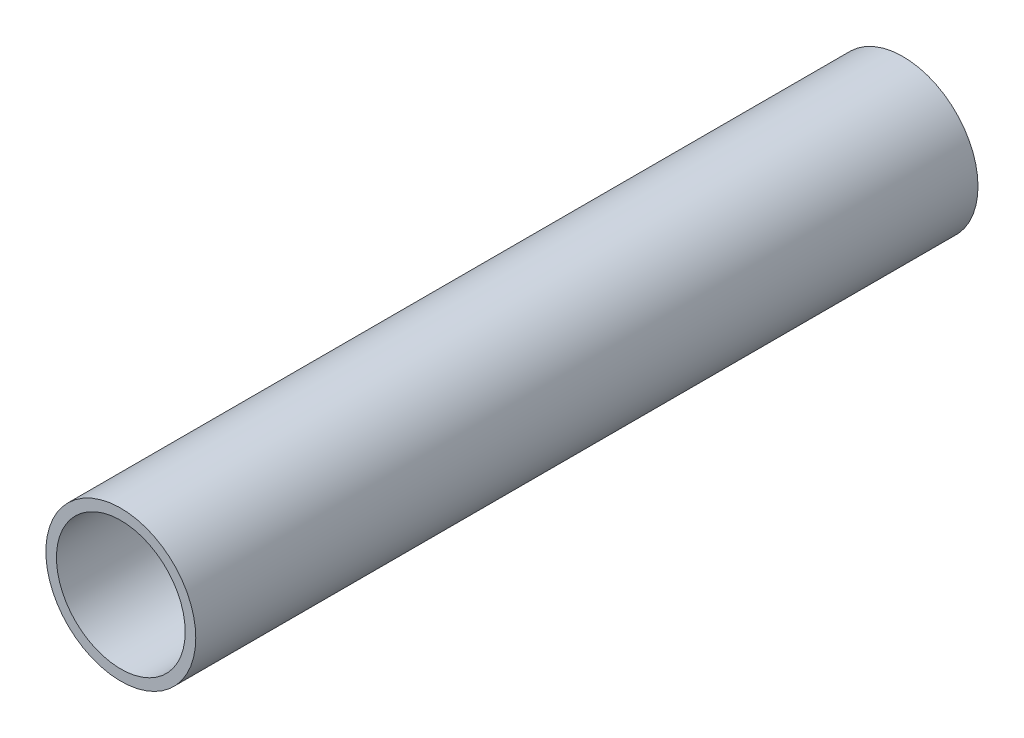
ISO-10303-21;
HEADER;
FILE_DESCRIPTION(('STEP AP214'),'2;1');
FILE_NAME('part.step','',(''),(''),'','','');
FILE_SCHEMA(('AUTOMOTIVE_DESIGN { 1 0 10303 214 1 1 1 1 }'));
ENDSEC;
DATA;
#1=APPLICATION_CONTEXT('core data for automotive mechanical design processes');
#2=APPLICATION_PROTOCOL_DEFINITION('international standard','automotive_design',2000,#1);
#3=PRODUCT_CONTEXT('',#1,'mechanical');
#4=PRODUCT('Part','Part','',(#3));
#5=PRODUCT_RELATED_PRODUCT_CATEGORY('part','',(#4));
#6=PRODUCT_DEFINITION_FORMATION('','',#4);
#7=PRODUCT_DEFINITION_CONTEXT('part definition',#1,'design');
#8=PRODUCT_DEFINITION('design','',#6,#7);
#9=PRODUCT_DEFINITION_SHAPE('','',#8);
#10=(LENGTH_UNIT() NAMED_UNIT(*) SI_UNIT(.MILLI.,.METRE.));
#11=(NAMED_UNIT(*) PLANE_ANGLE_UNIT() SI_UNIT($,.RADIAN.));
#12=(NAMED_UNIT(*) SI_UNIT($,.STERADIAN.) SOLID_ANGLE_UNIT());
#13=UNCERTAINTY_MEASURE_WITH_UNIT(LENGTH_MEASURE(1.E-05),#10,'distance_accuracy_value','');
#14=(GEOMETRIC_REPRESENTATION_CONTEXT(3) GLOBAL_UNCERTAINTY_ASSIGNED_CONTEXT((#13)) GLOBAL_UNIT_ASSIGNED_CONTEXT((#10,
#11,#12)) REPRESENTATION_CONTEXT('',''));
#15=CARTESIAN_POINT('',(0.,0.,0.));
#16=DIRECTION('',(0.,0.,1.));
#17=DIRECTION('',(1.,0.,0.));
#18=AXIS2_PLACEMENT_3D('',#15,#16,#17);
#19=CARTESIAN_POINT('',(0.,0.,381.));
#20=DIRECTION('',(0.,0.,1.));
#21=DIRECTION('',(1.,0.,0.));
#22=AXIS2_PLACEMENT_3D('',#19,#20,#21);
#23=PLANE('',#22);
#24=CARTESIAN_POINT('',(0.,0.,381.));
#25=DIRECTION('',(0.,0.,1.));
#26=DIRECTION('',(1.,0.,0.));
#27=AXIS2_PLACEMENT_3D('',#24,#25,#26);
#28=CIRCLE('',#27,36.5125);
#29=CARTESIAN_POINT('',(36.5125,0.,381.));
#30=VERTEX_POINT('',#29);
#31=EDGE_CURVE('E10',#30,#30,#28,.T.);
#32=ORIENTED_EDGE('',*,*,#31,.T.);
#33=EDGE_LOOP('',(#32));
#34=FACE_BOUND('',#33,.T.);
#35=CARTESIAN_POINT('',(0.,0.,381.));
#36=DIRECTION('',(0.,0.,1.));
#37=DIRECTION('',(1.,0.,0.));
#38=AXIS2_PLACEMENT_3D('',#35,#36,#37);
#39=CIRCLE('',#38,31.3563);
#40=CARTESIAN_POINT('',(31.3563,0.,381.));
#41=VERTEX_POINT('',#40);
#42=EDGE_CURVE('E42',#41,#41,#39,.T.);
#43=ORIENTED_EDGE('',*,*,#42,.F.);
#44=EDGE_LOOP('',(#43));
#45=FACE_BOUND('',#44,.T.);
#46=ADVANCED_FACE('F31',(#34,#45),#23,.T.);
#47=CARTESIAN_POINT('',(0.,0.,0.));
#48=DIRECTION('',(0.,0.,1.));
#49=DIRECTION('',(1.,0.,0.));
#50=AXIS2_PLACEMENT_3D('',#47,#48,#49);
#51=PLANE('',#50);
#52=CARTESIAN_POINT('',(0.,0.,0.));
#53=DIRECTION('',(0.,0.,1.));
#54=DIRECTION('',(1.,0.,0.));
#55=AXIS2_PLACEMENT_3D('',#52,#53,#54);
#56=CIRCLE('',#55,36.5125);
#57=CARTESIAN_POINT('',(36.5125,0.,0.));
#58=VERTEX_POINT('',#57);
#59=EDGE_CURVE('E35',#58,#58,#56,.T.);
#60=ORIENTED_EDGE('',*,*,#59,.F.);
#61=EDGE_LOOP('',(#60));
#62=FACE_BOUND('',#61,.T.);
#63=CARTESIAN_POINT('',(0.,0.,0.));
#64=DIRECTION('',(0.,0.,1.));
#65=DIRECTION('',(1.,0.,0.));
#66=AXIS2_PLACEMENT_3D('',#63,#64,#65);
#67=CIRCLE('',#66,31.3563);
#68=CARTESIAN_POINT('',(31.3563,0.,0.));
#69=VERTEX_POINT('',#68);
#70=EDGE_CURVE('E44',#69,#69,#67,.T.);
#71=ORIENTED_EDGE('',*,*,#70,.T.);
#72=EDGE_LOOP('',(#71));
#73=FACE_BOUND('',#72,.T.);
#74=ADVANCED_FACE('F54',(#62,#73),#51,.F.);
#75=CARTESIAN_POINT('',(0.,0.,381.));
#76=DIRECTION('',(0.,0.,-1.));
#77=DIRECTION('',(-1.,0.,0.));
#78=AXIS2_PLACEMENT_3D('',#75,#76,#77);
#79=CYLINDRICAL_SURFACE('',#78,36.5125);
#80=ORIENTED_EDGE('',*,*,#31,.F.);
#81=EDGE_LOOP('',(#80));
#82=FACE_BOUND('',#81,.T.);
#83=ORIENTED_EDGE('',*,*,#59,.T.);
#84=EDGE_LOOP('',(#83));
#85=FACE_BOUND('',#84,.T.);
#86=ADVANCED_FACE('F33',(#82,#85),#79,.T.);
#87=CARTESIAN_POINT('',(0.,0.,381.));
#88=DIRECTION('',(0.,0.,-1.));
#89=DIRECTION('',(-1.,0.,0.));
#90=AXIS2_PLACEMENT_3D('',#87,#88,#89);
#91=CYLINDRICAL_SURFACE('',#90,31.3563);
#92=ORIENTED_EDGE('',*,*,#42,.T.);
#93=EDGE_LOOP('',(#92));
#94=FACE_BOUND('',#93,.T.);
#95=ORIENTED_EDGE('',*,*,#70,.F.);
#96=EDGE_LOOP('',(#95));
#97=FACE_BOUND('',#96,.T.);
#98=ADVANCED_FACE('F50',(#94,#97),#91,.F.);
#99=CLOSED_SHELL('',(#46,#74,#86,#98));
#100=MANIFOLD_SOLID_BREP('B2',#99);
#101=ADVANCED_BREP_SHAPE_REPRESENTATION('',(#18,#100),#14);
#102=SHAPE_DEFINITION_REPRESENTATION(#9,#101);
ENDSEC;
END-ISO-10303-21;
